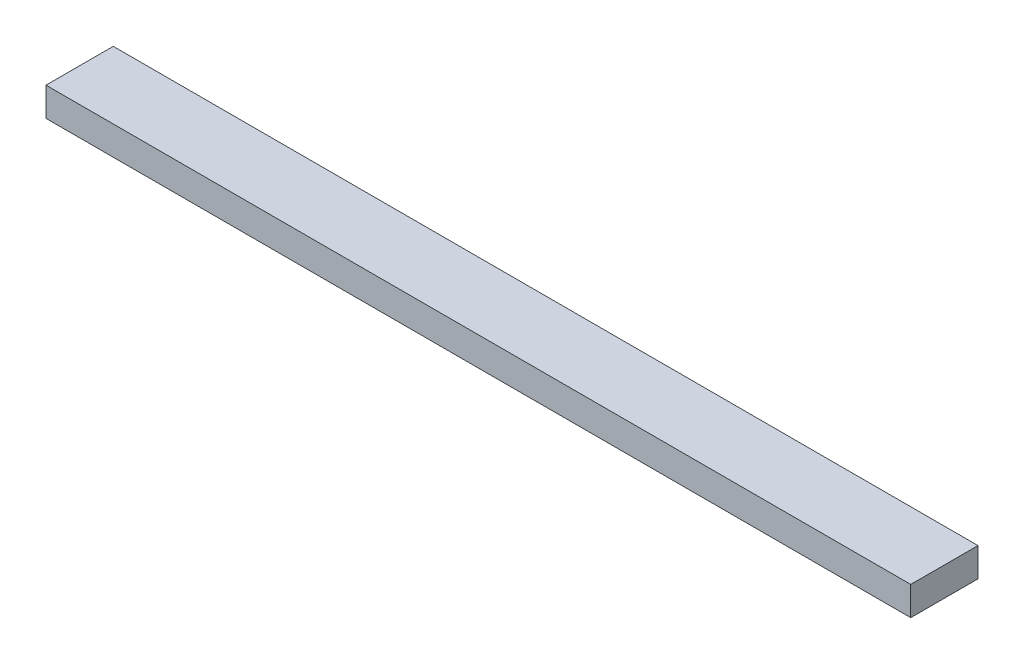
ISO-10303-21;
HEADER;
FILE_DESCRIPTION(('STEP AP214'),'2;1');
FILE_NAME('part.step','',(''),(''),'','','');
FILE_SCHEMA(('AUTOMOTIVE_DESIGN { 1 0 10303 214 1 1 1 1 }'));
ENDSEC;
DATA;
#1=APPLICATION_CONTEXT('core data for automotive mechanical design processes');
#2=APPLICATION_PROTOCOL_DEFINITION('international standard','automotive_design',2000,#1);
#3=PRODUCT_CONTEXT('',#1,'mechanical');
#4=PRODUCT('Part','Part','',(#3));
#5=PRODUCT_RELATED_PRODUCT_CATEGORY('part','',(#4));
#6=PRODUCT_DEFINITION_FORMATION('','',#4);
#7=PRODUCT_DEFINITION_CONTEXT('part definition',#1,'design');
#8=PRODUCT_DEFINITION('design','',#6,#7);
#9=PRODUCT_DEFINITION_SHAPE('','',#8);
#10=(LENGTH_UNIT() NAMED_UNIT(*) SI_UNIT(.MILLI.,.METRE.));
#11=(NAMED_UNIT(*) PLANE_ANGLE_UNIT() SI_UNIT($,.RADIAN.));
#12=(NAMED_UNIT(*) SI_UNIT($,.STERADIAN.) SOLID_ANGLE_UNIT());
#13=UNCERTAINTY_MEASURE_WITH_UNIT(LENGTH_MEASURE(1.E-05),#10,'distance_accuracy_value','');
#14=(GEOMETRIC_REPRESENTATION_CONTEXT(3) GLOBAL_UNCERTAINTY_ASSIGNED_CONTEXT((#13)) GLOBAL_UNIT_ASSIGNED_CONTEXT((#10,
#11,#12)) REPRESENTATION_CONTEXT('',''));
#15=CARTESIAN_POINT('',(0.,0.,0.));
#16=DIRECTION('',(0.,0.,1.));
#17=DIRECTION('',(1.,0.,0.));
#18=AXIS2_PLACEMENT_3D('',#15,#16,#17);
#19=CARTESIAN_POINT('',(0.,38.1,0.));
#20=DIRECTION('',(1.,0.,0.));
#21=DIRECTION('',(0.,0.,-1.));
#22=AXIS2_PLACEMENT_3D('',#19,#20,#21);
#23=PLANE('',#22);
#24=DIRECTION('',(0.,0.,1.));
#25=VECTOR('',#24,1.);
#26=CARTESIAN_POINT('',(0.,0.,0.));
#27=LINE('',#26,#25);
#28=CARTESIAN_POINT('',(0.,0.,-88.9));
#29=VERTEX_POINT('',#28);
#30=CARTESIAN_POINT('',(0.,0.,0.));
#31=VERTEX_POINT('',#30);
#32=EDGE_CURVE('E102',#29,#31,#27,.T.);
#33=ORIENTED_EDGE('',*,*,#32,.T.);
#34=DIRECTION('',(0.,-1.,0.));
#35=VECTOR('',#34,1.);
#36=CARTESIAN_POINT('',(0.,38.1,0.));
#37=LINE('',#36,#35);
#38=CARTESIAN_POINT('',(0.,38.1,0.));
#39=VERTEX_POINT('',#38);
#40=EDGE_CURVE('E11',#39,#31,#37,.T.);
#41=ORIENTED_EDGE('',*,*,#40,.F.);
#42=DIRECTION('',(0.,0.,1.));
#43=VECTOR('',#42,1.);
#44=CARTESIAN_POINT('',(0.,38.1,0.));
#45=LINE('',#44,#43);
#46=CARTESIAN_POINT('',(0.,38.1,-88.9));
#47=VERTEX_POINT('',#46);
#48=EDGE_CURVE('E90',#47,#39,#45,.T.);
#49=ORIENTED_EDGE('',*,*,#48,.F.);
#50=DIRECTION('',(0.,-1.,0.));
#51=VECTOR('',#50,1.);
#52=CARTESIAN_POINT('',(0.,38.1,-88.9));
#53=LINE('',#52,#51);
#54=EDGE_CURVE('E98',#47,#29,#53,.T.);
#55=ORIENTED_EDGE('',*,*,#54,.T.);
#56=EDGE_LOOP('',(#33,#41,#49,#55));
#57=FACE_BOUND('',#56,.T.);
#58=ADVANCED_FACE('F39',(#57),#23,.F.);
#59=CARTESIAN_POINT('',(0.,38.1,0.));
#60=DIRECTION('',(0.,0.,-1.));
#61=DIRECTION('',(-1.,0.,0.));
#62=AXIS2_PLACEMENT_3D('',#59,#60,#61);
#63=PLANE('',#62);
#64=DIRECTION('',(1.,0.,0.));
#65=VECTOR('',#64,1.);
#66=CARTESIAN_POINT('',(0.,0.,0.));
#67=LINE('',#66,#65);
#68=CARTESIAN_POINT('',(1143.,0.,0.));
#69=VERTEX_POINT('',#68);
#70=EDGE_CURVE('E94',#31,#69,#67,.T.);
#71=ORIENTED_EDGE('',*,*,#70,.T.);
#72=DIRECTION('',(0.,-1.,0.));
#73=VECTOR('',#72,1.);
#74=CARTESIAN_POINT('',(1143.,38.1,0.));
#75=LINE('',#74,#73);
#76=CARTESIAN_POINT('',(1143.,38.1,0.));
#77=VERTEX_POINT('',#76);
#78=EDGE_CURVE('E47',#77,#69,#75,.T.);
#79=ORIENTED_EDGE('',*,*,#78,.F.);
#80=DIRECTION('',(1.,0.,0.));
#81=VECTOR('',#80,1.);
#82=CARTESIAN_POINT('',(0.,38.1,0.));
#83=LINE('',#82,#81);
#84=EDGE_CURVE('E85',#39,#77,#83,.T.);
#85=ORIENTED_EDGE('',*,*,#84,.F.);
#86=ORIENTED_EDGE('',*,*,#40,.T.);
#87=EDGE_LOOP('',(#71,#79,#85,#86));
#88=FACE_BOUND('',#87,.T.);
#89=ADVANCED_FACE('F93',(#88),#63,.F.);
#90=CARTESIAN_POINT('',(1143.,38.1,0.));
#91=DIRECTION('',(-1.,0.,0.));
#92=DIRECTION('',(0.,0.,1.));
#93=AXIS2_PLACEMENT_3D('',#90,#91,#92);
#94=PLANE('',#93);
#95=DIRECTION('',(0.,0.,-1.));
#96=VECTOR('',#95,1.);
#97=CARTESIAN_POINT('',(1143.,0.,0.));
#98=LINE('',#97,#96);
#99=CARTESIAN_POINT('',(1143.,0.,-88.9));
#100=VERTEX_POINT('',#99);
#101=EDGE_CURVE('E72',#69,#100,#98,.T.);
#102=ORIENTED_EDGE('',*,*,#101,.T.);
#103=DIRECTION('',(0.,-1.,0.));
#104=VECTOR('',#103,1.);
#105=CARTESIAN_POINT('',(1143.,38.1,-88.9));
#106=LINE('',#105,#104);
#107=CARTESIAN_POINT('',(1143.,38.1,-88.9));
#108=VERTEX_POINT('',#107);
#109=EDGE_CURVE('E95',#108,#100,#106,.T.);
#110=ORIENTED_EDGE('',*,*,#109,.F.);
#111=DIRECTION('',(0.,0.,-1.));
#112=VECTOR('',#111,1.);
#113=CARTESIAN_POINT('',(1143.,38.1,0.));
#114=LINE('',#113,#112);
#115=EDGE_CURVE('E88',#77,#108,#114,.T.);
#116=ORIENTED_EDGE('',*,*,#115,.F.);
#117=ORIENTED_EDGE('',*,*,#78,.T.);
#118=EDGE_LOOP('',(#102,#110,#116,#117));
#119=FACE_BOUND('',#118,.T.);
#120=ADVANCED_FACE('F96',(#119),#94,.F.);
#121=CARTESIAN_POINT('',(0.,38.1,-88.9));
#122=DIRECTION('',(0.,0.,1.));
#123=DIRECTION('',(1.,0.,0.));
#124=AXIS2_PLACEMENT_3D('',#121,#122,#123);
#125=PLANE('',#124);
#126=DIRECTION('',(-1.,0.,0.));
#127=VECTOR('',#126,1.);
#128=CARTESIAN_POINT('',(0.,0.,-88.9));
#129=LINE('',#128,#127);
#130=EDGE_CURVE('E78',#100,#29,#129,.T.);
#131=ORIENTED_EDGE('',*,*,#130,.T.);
#132=ORIENTED_EDGE('',*,*,#54,.F.);
#133=DIRECTION('',(-1.,0.,0.));
#134=VECTOR('',#133,1.);
#135=CARTESIAN_POINT('',(0.,38.1,-88.9));
#136=LINE('',#135,#134);
#137=EDGE_CURVE('E55',#108,#47,#136,.T.);
#138=ORIENTED_EDGE('',*,*,#137,.F.);
#139=ORIENTED_EDGE('',*,*,#109,.T.);
#140=EDGE_LOOP('',(#131,#132,#138,#139));
#141=FACE_BOUND('',#140,.T.);
#142=ADVANCED_FACE('F109',(#141),#125,.F.);
#143=CARTESIAN_POINT('',(0.,38.1,0.));
#144=DIRECTION('',(0.,-1.,0.));
#145=DIRECTION('',(0.,0.,-1.));
#146=AXIS2_PLACEMENT_3D('',#143,#144,#145);
#147=PLANE('',#146);
#148=ORIENTED_EDGE('',*,*,#48,.T.);
#149=ORIENTED_EDGE('',*,*,#84,.T.);
#150=ORIENTED_EDGE('',*,*,#115,.T.);
#151=ORIENTED_EDGE('',*,*,#137,.T.);
#152=EDGE_LOOP('',(#148,#149,#150,#151));
#153=FACE_BOUND('',#152,.T.);
#154=ADVANCED_FACE('F86',(#153),#147,.F.);
#155=CARTESIAN_POINT('',(0.,0.,0.));
#156=DIRECTION('',(0.,-1.,0.));
#157=DIRECTION('',(0.,0.,-1.));
#158=AXIS2_PLACEMENT_3D('',#155,#156,#157);
#159=PLANE('',#158);
#160=ORIENTED_EDGE('',*,*,#32,.F.);
#161=ORIENTED_EDGE('',*,*,#130,.F.);
#162=ORIENTED_EDGE('',*,*,#101,.F.);
#163=ORIENTED_EDGE('',*,*,#70,.F.);
#164=EDGE_LOOP('',(#160,#161,#162,#163));
#165=FACE_BOUND('',#164,.T.);
#166=ADVANCED_FACE('F112',(#165),#159,.T.);
#167=CLOSED_SHELL('',(#58,#89,#120,#142,#154,#166));
#168=MANIFOLD_SOLID_BREP('B2',#167);
#169=ADVANCED_BREP_SHAPE_REPRESENTATION('',(#18,#168),#14);
#170=SHAPE_DEFINITION_REPRESENTATION(#9,#169);
ENDSEC;
END-ISO-10303-21;
